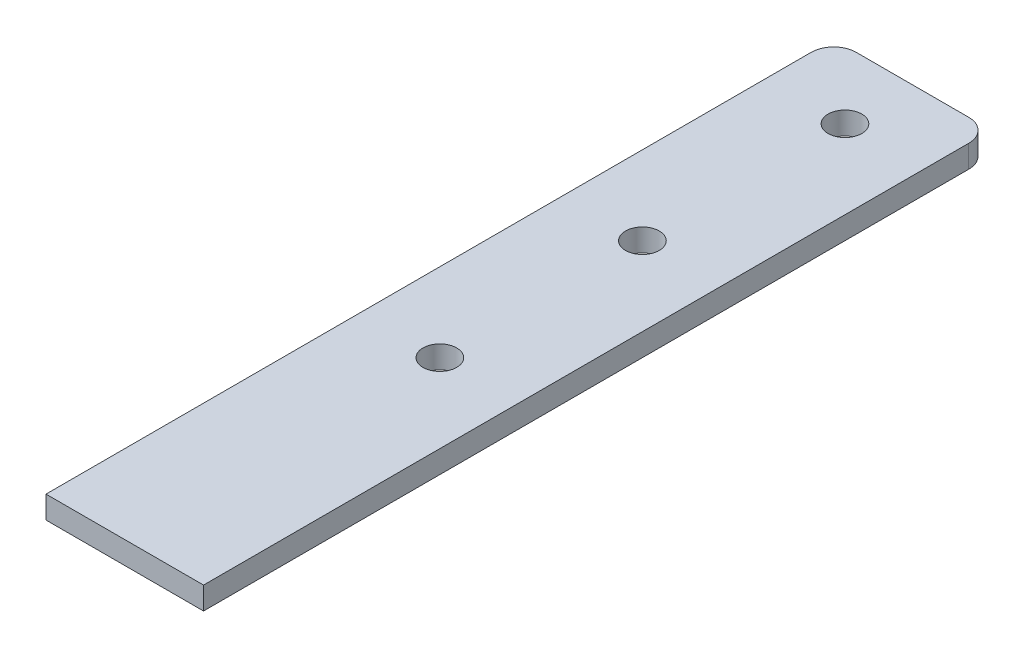
ISO-10303-21;
HEADER;
FILE_DESCRIPTION(('STEP AP214'),'2;1');
FILE_NAME('part.step','',(''),(''),'','','');
FILE_SCHEMA(('AUTOMOTIVE_DESIGN { 1 0 10303 214 1 1 1 1 }'));
ENDSEC;
DATA;
#1=APPLICATION_CONTEXT('core data for automotive mechanical design processes');
#2=APPLICATION_PROTOCOL_DEFINITION('international standard','automotive_design',2000,#1);
#3=PRODUCT_CONTEXT('',#1,'mechanical');
#4=PRODUCT('Part','Part','',(#3));
#5=PRODUCT_RELATED_PRODUCT_CATEGORY('part','',(#4));
#6=PRODUCT_DEFINITION_FORMATION('','',#4);
#7=PRODUCT_DEFINITION_CONTEXT('part definition',#1,'design');
#8=PRODUCT_DEFINITION('design','',#6,#7);
#9=PRODUCT_DEFINITION_SHAPE('','',#8);
#10=(LENGTH_UNIT() NAMED_UNIT(*) SI_UNIT(.MILLI.,.METRE.));
#11=(NAMED_UNIT(*) PLANE_ANGLE_UNIT() SI_UNIT($,.RADIAN.));
#12=(NAMED_UNIT(*) SI_UNIT($,.STERADIAN.) SOLID_ANGLE_UNIT());
#13=UNCERTAINTY_MEASURE_WITH_UNIT(LENGTH_MEASURE(1.E-05),#10,'distance_accuracy_value','');
#14=(GEOMETRIC_REPRESENTATION_CONTEXT(3) GLOBAL_UNCERTAINTY_ASSIGNED_CONTEXT((#13)) GLOBAL_UNIT_ASSIGNED_CONTEXT((#10,
#11,#12)) REPRESENTATION_CONTEXT('',''));
#15=CARTESIAN_POINT('',(0.,0.,0.));
#16=DIRECTION('',(0.,0.,1.));
#17=DIRECTION('',(1.,0.,0.));
#18=AXIS2_PLACEMENT_3D('',#15,#16,#17);
#19=CARTESIAN_POINT('',(-25.,10.,-165.));
#20=DIRECTION('',(0.,1.,0.));
#21=DIRECTION('',(0.,0.,1.));
#22=AXIS2_PLACEMENT_3D('',#19,#20,#21);
#23=PLANE('',#22);
#24=CARTESIAN_POINT('',(0.,10.,-145.));
#25=DIRECTION('',(0.,1.,0.));
#26=DIRECTION('',(0.,0.,1.));
#27=AXIS2_PLACEMENT_3D('',#24,#25,#26);
#28=CIRCLE('',#27,7.50000000000001);
#29=CARTESIAN_POINT('',(0.,10.,-137.5));
#30=VERTEX_POINT('',#29);
#31=EDGE_CURVE('E254',#30,#30,#28,.T.);
#32=ORIENTED_EDGE('',*,*,#31,.F.);
#33=EDGE_LOOP('',(#32));
#34=FACE_BOUND('',#33,.T.);
#35=CARTESIAN_POINT('',(-25.,10.,-165.));
#36=DIRECTION('',(0.,1.,0.));
#37=DIRECTION('',(0.,0.,1.));
#38=AXIS2_PLACEMENT_3D('',#35,#36,#37);
#39=CIRCLE('',#38,10.);
#40=CARTESIAN_POINT('',(-25.,10.,-175.));
#41=VERTEX_POINT('',#40);
#42=CARTESIAN_POINT('',(-35.,10.,-165.));
#43=VERTEX_POINT('',#42);
#44=EDGE_CURVE('E150',#41,#43,#39,.T.);
#45=ORIENTED_EDGE('',*,*,#44,.T.);
#46=DIRECTION('',(0.,0.,-1.));
#47=VECTOR('',#46,1.);
#48=CARTESIAN_POINT('',(-35.,10.,175.));
#49=LINE('',#48,#47);
#50=CARTESIAN_POINT('',(-35.,10.,175.));
#51=VERTEX_POINT('',#50);
#52=EDGE_CURVE('E212',#51,#43,#49,.T.);
#53=ORIENTED_EDGE('',*,*,#52,.F.);
#54=DIRECTION('',(1.,0.,0.));
#55=VECTOR('',#54,1.);
#56=CARTESIAN_POINT('',(-35.,10.,175.));
#57=LINE('',#56,#55);
#58=CARTESIAN_POINT('',(35.,10.,175.));
#59=VERTEX_POINT('',#58);
#60=EDGE_CURVE('E166',#51,#59,#57,.T.);
#61=ORIENTED_EDGE('',*,*,#60,.T.);
#62=DIRECTION('',(0.,0.,-1.));
#63=VECTOR('',#62,1.);
#64=CARTESIAN_POINT('',(35.,10.,175.));
#65=LINE('',#64,#63);
#66=CARTESIAN_POINT('',(35.,10.,-165.));
#67=VERTEX_POINT('',#66);
#68=EDGE_CURVE('E160',#59,#67,#65,.T.);
#69=ORIENTED_EDGE('',*,*,#68,.T.);
#70=CARTESIAN_POINT('',(25.,10.,-165.));
#71=DIRECTION('',(0.,-1.,0.));
#72=DIRECTION('',(0.,0.,-1.));
#73=AXIS2_PLACEMENT_3D('',#70,#71,#72);
#74=CIRCLE('',#73,10.);
#75=CARTESIAN_POINT('',(25.,10.,-175.));
#76=VERTEX_POINT('',#75);
#77=EDGE_CURVE('E164',#76,#67,#74,.T.);
#78=ORIENTED_EDGE('',*,*,#77,.F.);
#79=DIRECTION('',(1.,0.,0.));
#80=VECTOR('',#79,1.);
#81=CARTESIAN_POINT('',(-25.,10.,-175.));
#82=LINE('',#81,#80);
#83=EDGE_CURVE('E181',#41,#76,#82,.T.);
#84=ORIENTED_EDGE('',*,*,#83,.F.);
#85=EDGE_LOOP('',(#45,#53,#61,#69,#78,#84));
#86=FACE_BOUND('',#85,.T.);
#87=CARTESIAN_POINT('',(0.,10.,-55.0000000000002));
#88=DIRECTION('',(0.,1.,0.));
#89=DIRECTION('',(0.,0.,1.));
#90=AXIS2_PLACEMENT_3D('',#87,#88,#89);
#91=CIRCLE('',#90,7.5);
#92=CARTESIAN_POINT('',(0.,10.,-47.5000000000002));
#93=VERTEX_POINT('',#92);
#94=EDGE_CURVE('E189',#93,#93,#91,.T.);
#95=ORIENTED_EDGE('',*,*,#94,.F.);
#96=EDGE_LOOP('',(#95));
#97=FACE_BOUND('',#96,.T.);
#98=CARTESIAN_POINT('',(0.,10.,34.9999999999998));
#99=DIRECTION('',(0.,1.,0.));
#100=DIRECTION('',(0.,0.,1.));
#101=AXIS2_PLACEMENT_3D('',#98,#99,#100);
#102=CIRCLE('',#101,7.5);
#103=CARTESIAN_POINT('',(0.,10.,42.4999999999998));
#104=VERTEX_POINT('',#103);
#105=EDGE_CURVE('E245',#104,#104,#102,.T.);
#106=ORIENTED_EDGE('',*,*,#105,.F.);
#107=EDGE_LOOP('',(#106));
#108=FACE_BOUND('',#107,.T.);
#109=ADVANCED_FACE('F102',(#34,#86,#97,#108),#23,.T.);
#110=CARTESIAN_POINT('',(-25.,0.,-165.));
#111=DIRECTION('',(0.,1.,0.));
#112=DIRECTION('',(0.,0.,1.));
#113=AXIS2_PLACEMENT_3D('',#110,#111,#112);
#114=PLANE('',#113);
#115=CARTESIAN_POINT('',(-25.,0.,-165.));
#116=DIRECTION('',(0.,1.,0.));
#117=DIRECTION('',(0.,0.,1.));
#118=AXIS2_PLACEMENT_3D('',#115,#116,#117);
#119=CIRCLE('',#118,10.);
#120=CARTESIAN_POINT('',(-25.,0.,-175.));
#121=VERTEX_POINT('',#120);
#122=CARTESIAN_POINT('',(-35.,0.,-165.));
#123=VERTEX_POINT('',#122);
#124=EDGE_CURVE('E186',#121,#123,#119,.T.);
#125=ORIENTED_EDGE('',*,*,#124,.F.);
#126=DIRECTION('',(1.,0.,0.));
#127=VECTOR('',#126,1.);
#128=CARTESIAN_POINT('',(-25.,0.,-175.));
#129=LINE('',#128,#127);
#130=CARTESIAN_POINT('',(25.,0.,-175.));
#131=VERTEX_POINT('',#130);
#132=EDGE_CURVE('E197',#121,#131,#129,.T.);
#133=ORIENTED_EDGE('',*,*,#132,.T.);
#134=CARTESIAN_POINT('',(25.,0.,-165.));
#135=DIRECTION('',(0.,-1.,0.));
#136=DIRECTION('',(0.,0.,-1.));
#137=AXIS2_PLACEMENT_3D('',#134,#135,#136);
#138=CIRCLE('',#137,10.);
#139=CARTESIAN_POINT('',(35.,0.,-165.));
#140=VERTEX_POINT('',#139);
#141=EDGE_CURVE('E195',#131,#140,#138,.T.);
#142=ORIENTED_EDGE('',*,*,#141,.T.);
#143=DIRECTION('',(0.,0.,-1.));
#144=VECTOR('',#143,1.);
#145=CARTESIAN_POINT('',(35.,0.,175.));
#146=LINE('',#145,#144);
#147=CARTESIAN_POINT('',(35.,0.,175.));
#148=VERTEX_POINT('',#147);
#149=EDGE_CURVE('E175',#148,#140,#146,.T.);
#150=ORIENTED_EDGE('',*,*,#149,.F.);
#151=DIRECTION('',(1.,0.,0.));
#152=VECTOR('',#151,1.);
#153=CARTESIAN_POINT('',(-35.,0.,175.));
#154=LINE('',#153,#152);
#155=CARTESIAN_POINT('',(-35.,0.,175.));
#156=VERTEX_POINT('',#155);
#157=EDGE_CURVE('E192',#156,#148,#154,.T.);
#158=ORIENTED_EDGE('',*,*,#157,.F.);
#159=DIRECTION('',(0.,0.,-1.));
#160=VECTOR('',#159,1.);
#161=CARTESIAN_POINT('',(-35.,0.,175.));
#162=LINE('',#161,#160);
#163=EDGE_CURVE('E188',#156,#123,#162,.T.);
#164=ORIENTED_EDGE('',*,*,#163,.T.);
#165=EDGE_LOOP('',(#125,#133,#142,#150,#158,#164));
#166=FACE_BOUND('',#165,.T.);
#167=CARTESIAN_POINT('',(0.,0.,-55.0000000000002));
#168=DIRECTION('',(0.,1.,0.));
#169=DIRECTION('',(0.,0.,1.));
#170=AXIS2_PLACEMENT_3D('',#167,#168,#169);
#171=CIRCLE('',#170,7.5);
#172=CARTESIAN_POINT('',(0.,0.,-47.5000000000002));
#173=VERTEX_POINT('',#172);
#174=EDGE_CURVE('E257',#173,#173,#171,.T.);
#175=ORIENTED_EDGE('',*,*,#174,.T.);
#176=EDGE_LOOP('',(#175));
#177=FACE_BOUND('',#176,.T.);
#178=CARTESIAN_POINT('',(0.,0.,-145.));
#179=DIRECTION('',(0.,1.,0.));
#180=DIRECTION('',(0.,0.,1.));
#181=AXIS2_PLACEMENT_3D('',#178,#179,#180);
#182=CIRCLE('',#181,7.50000000000001);
#183=CARTESIAN_POINT('',(0.,0.,-137.5));
#184=VERTEX_POINT('',#183);
#185=EDGE_CURVE('E251',#184,#184,#182,.T.);
#186=ORIENTED_EDGE('',*,*,#185,.T.);
#187=EDGE_LOOP('',(#186));
#188=FACE_BOUND('',#187,.T.);
#189=CARTESIAN_POINT('',(0.,0.,34.9999999999998));
#190=DIRECTION('',(0.,1.,0.));
#191=DIRECTION('',(0.,0.,1.));
#192=AXIS2_PLACEMENT_3D('',#189,#190,#191);
#193=CIRCLE('',#192,7.5);
#194=CARTESIAN_POINT('',(0.,0.,42.4999999999998));
#195=VERTEX_POINT('',#194);
#196=EDGE_CURVE('E248',#195,#195,#193,.T.);
#197=ORIENTED_EDGE('',*,*,#196,.T.);
#198=EDGE_LOOP('',(#197));
#199=FACE_BOUND('',#198,.T.);
#200=ADVANCED_FACE('F209',(#166,#177,#188,#199),#114,.F.);
#201=CARTESIAN_POINT('',(-25.,10.,-165.));
#202=DIRECTION('',(0.,-1.,0.));
#203=DIRECTION('',(0.,0.,-1.));
#204=AXIS2_PLACEMENT_3D('',#201,#202,#203);
#205=CYLINDRICAL_SURFACE('',#204,10.);
#206=ORIENTED_EDGE('',*,*,#124,.T.);
#207=DIRECTION('',(0.,-1.,0.));
#208=VECTOR('',#207,1.);
#209=CARTESIAN_POINT('',(-35.,10.,-165.));
#210=LINE('',#209,#208);
#211=EDGE_CURVE('E12',#43,#123,#210,.T.);
#212=ORIENTED_EDGE('',*,*,#211,.F.);
#213=ORIENTED_EDGE('',*,*,#44,.F.);
#214=DIRECTION('',(0.,-1.,0.));
#215=VECTOR('',#214,1.);
#216=CARTESIAN_POINT('',(-25.,10.,-175.));
#217=LINE('',#216,#215);
#218=EDGE_CURVE('E119',#41,#121,#217,.T.);
#219=ORIENTED_EDGE('',*,*,#218,.T.);
#220=EDGE_LOOP('',(#206,#212,#213,#219));
#221=FACE_BOUND('',#220,.T.);
#222=ADVANCED_FACE('F104',(#221),#205,.T.);
#223=CARTESIAN_POINT('',(-35.,10.,175.));
#224=DIRECTION('',(-1.,0.,0.));
#225=DIRECTION('',(0.,0.,1.));
#226=AXIS2_PLACEMENT_3D('',#223,#224,#225);
#227=PLANE('',#226);
#228=ORIENTED_EDGE('',*,*,#163,.F.);
#229=DIRECTION('',(0.,-1.,0.));
#230=VECTOR('',#229,1.);
#231=CARTESIAN_POINT('',(-35.,10.,175.));
#232=LINE('',#231,#230);
#233=EDGE_CURVE('E111',#51,#156,#232,.T.);
#234=ORIENTED_EDGE('',*,*,#233,.F.);
#235=ORIENTED_EDGE('',*,*,#52,.T.);
#236=ORIENTED_EDGE('',*,*,#211,.T.);
#237=EDGE_LOOP('',(#228,#234,#235,#236));
#238=FACE_BOUND('',#237,.T.);
#239=ADVANCED_FACE('F211',(#238),#227,.T.);
#240=CARTESIAN_POINT('',(-35.,10.,175.));
#241=DIRECTION('',(0.,0.,-1.));
#242=DIRECTION('',(-1.,0.,0.));
#243=AXIS2_PLACEMENT_3D('',#240,#241,#242);
#244=PLANE('',#243);
#245=ORIENTED_EDGE('',*,*,#157,.T.);
#246=DIRECTION('',(0.,-1.,0.));
#247=VECTOR('',#246,1.);
#248=CARTESIAN_POINT('',(35.,10.,175.));
#249=LINE('',#248,#247);
#250=EDGE_CURVE('E178',#59,#148,#249,.T.);
#251=ORIENTED_EDGE('',*,*,#250,.F.);
#252=ORIENTED_EDGE('',*,*,#60,.F.);
#253=ORIENTED_EDGE('',*,*,#233,.T.);
#254=EDGE_LOOP('',(#245,#251,#252,#253));
#255=FACE_BOUND('',#254,.T.);
#256=ADVANCED_FACE('F204',(#255),#244,.F.);
#257=CARTESIAN_POINT('',(35.,10.,175.));
#258=DIRECTION('',(-1.,0.,0.));
#259=DIRECTION('',(0.,0.,1.));
#260=AXIS2_PLACEMENT_3D('',#257,#258,#259);
#261=PLANE('',#260);
#262=ORIENTED_EDGE('',*,*,#149,.T.);
#263=DIRECTION('',(0.,-1.,0.));
#264=VECTOR('',#263,1.);
#265=CARTESIAN_POINT('',(35.,10.,-165.));
#266=LINE('',#265,#264);
#267=EDGE_CURVE('E172',#67,#140,#266,.T.);
#268=ORIENTED_EDGE('',*,*,#267,.F.);
#269=ORIENTED_EDGE('',*,*,#68,.F.);
#270=ORIENTED_EDGE('',*,*,#250,.T.);
#271=EDGE_LOOP('',(#262,#268,#269,#270));
#272=FACE_BOUND('',#271,.T.);
#273=ADVANCED_FACE('F173',(#272),#261,.F.);
#274=CARTESIAN_POINT('',(25.,10.,-165.));
#275=DIRECTION('',(0.,-1.,0.));
#276=DIRECTION('',(0.,0.,-1.));
#277=AXIS2_PLACEMENT_3D('',#274,#275,#276);
#278=CYLINDRICAL_SURFACE('',#277,10.);
#279=ORIENTED_EDGE('',*,*,#141,.F.);
#280=DIRECTION('',(0.,-1.,0.));
#281=VECTOR('',#280,1.);
#282=CARTESIAN_POINT('',(25.,10.,-175.));
#283=LINE('',#282,#281);
#284=EDGE_CURVE('E138',#76,#131,#283,.T.);
#285=ORIENTED_EDGE('',*,*,#284,.F.);
#286=ORIENTED_EDGE('',*,*,#77,.T.);
#287=ORIENTED_EDGE('',*,*,#267,.T.);
#288=EDGE_LOOP('',(#279,#285,#286,#287));
#289=FACE_BOUND('',#288,.T.);
#290=ADVANCED_FACE('F180',(#289),#278,.T.);
#291=CARTESIAN_POINT('',(-25.,10.,-175.));
#292=DIRECTION('',(0.,0.,-1.));
#293=DIRECTION('',(-1.,0.,0.));
#294=AXIS2_PLACEMENT_3D('',#291,#292,#293);
#295=PLANE('',#294);
#296=ORIENTED_EDGE('',*,*,#132,.F.);
#297=ORIENTED_EDGE('',*,*,#218,.F.);
#298=ORIENTED_EDGE('',*,*,#83,.T.);
#299=ORIENTED_EDGE('',*,*,#284,.T.);
#300=EDGE_LOOP('',(#296,#297,#298,#299));
#301=FACE_BOUND('',#300,.T.);
#302=ADVANCED_FACE('F213',(#301),#295,.T.);
#303=CARTESIAN_POINT('',(0.,10.,-55.0000000000002));
#304=DIRECTION('',(0.,-1.,0.));
#305=DIRECTION('',(0.,0.,-1.));
#306=AXIS2_PLACEMENT_3D('',#303,#304,#305);
#307=CYLINDRICAL_SURFACE('',#306,7.5);
#308=ORIENTED_EDGE('',*,*,#94,.T.);
#309=EDGE_LOOP('',(#308));
#310=FACE_BOUND('',#309,.T.);
#311=ORIENTED_EDGE('',*,*,#174,.F.);
#312=EDGE_LOOP('',(#311));
#313=FACE_BOUND('',#312,.T.);
#314=ADVANCED_FACE('F215',(#310,#313),#307,.F.);
#315=CARTESIAN_POINT('',(0.,10.,-145.));
#316=DIRECTION('',(0.,-1.,0.));
#317=DIRECTION('',(0.,0.,-1.));
#318=AXIS2_PLACEMENT_3D('',#315,#316,#317);
#319=CYLINDRICAL_SURFACE('',#318,7.50000000000001);
#320=ORIENTED_EDGE('',*,*,#31,.T.);
#321=EDGE_LOOP('',(#320));
#322=FACE_BOUND('',#321,.T.);
#323=ORIENTED_EDGE('',*,*,#185,.F.);
#324=EDGE_LOOP('',(#323));
#325=FACE_BOUND('',#324,.T.);
#326=ADVANCED_FACE('F221',(#322,#325),#319,.F.);
#327=CARTESIAN_POINT('',(0.,10.,34.9999999999998));
#328=DIRECTION('',(0.,-1.,0.));
#329=DIRECTION('',(0.,0.,-1.));
#330=AXIS2_PLACEMENT_3D('',#327,#328,#329);
#331=CYLINDRICAL_SURFACE('',#330,7.5);
#332=ORIENTED_EDGE('',*,*,#105,.T.);
#333=EDGE_LOOP('',(#332));
#334=FACE_BOUND('',#333,.T.);
#335=ORIENTED_EDGE('',*,*,#196,.F.);
#336=EDGE_LOOP('',(#335));
#337=FACE_BOUND('',#336,.T.);
#338=ADVANCED_FACE('F236',(#334,#337),#331,.F.);
#339=CLOSED_SHELL('',(#109,#200,#222,#239,#256,#273,#290,#302,#314,#326,#338));
#340=MANIFOLD_SOLID_BREP('B2',#339);
#341=ADVANCED_BREP_SHAPE_REPRESENTATION('',(#18,#340),#14);
#342=SHAPE_DEFINITION_REPRESENTATION(#9,#341);
ENDSEC;
END-ISO-10303-21;
